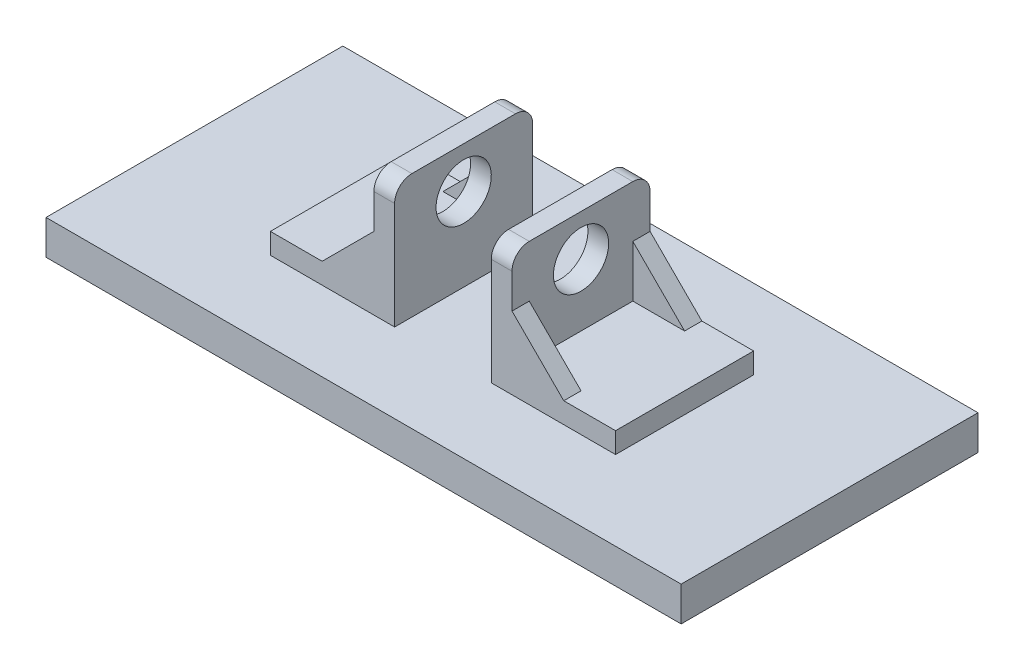
ISO-10303-21;
HEADER;
FILE_DESCRIPTION(('STEP AP214'),'2;1');
FILE_NAME('part.step','',(''),(''),'','','');
FILE_SCHEMA(('AUTOMOTIVE_DESIGN { 1 0 10303 214 1 1 1 1 }'));
ENDSEC;
DATA;
#1=APPLICATION_CONTEXT('core data for automotive mechanical design processes');
#2=APPLICATION_PROTOCOL_DEFINITION('international standard','automotive_design',2000,#1);
#3=PRODUCT_CONTEXT('',#1,'mechanical');
#4=PRODUCT('Part','Part','',(#3));
#5=PRODUCT_RELATED_PRODUCT_CATEGORY('part','',(#4));
#6=PRODUCT_DEFINITION_FORMATION('','',#4);
#7=PRODUCT_DEFINITION_CONTEXT('part definition',#1,'design');
#8=PRODUCT_DEFINITION('design','',#6,#7);
#9=PRODUCT_DEFINITION_SHAPE('','',#8);
#10=(LENGTH_UNIT() NAMED_UNIT(*) SI_UNIT(.MILLI.,.METRE.));
#11=(NAMED_UNIT(*) PLANE_ANGLE_UNIT() SI_UNIT($,.RADIAN.));
#12=(NAMED_UNIT(*) SI_UNIT($,.STERADIAN.) SOLID_ANGLE_UNIT());
#13=UNCERTAINTY_MEASURE_WITH_UNIT(LENGTH_MEASURE(1.E-05),#10,'distance_accuracy_value','');
#14=(GEOMETRIC_REPRESENTATION_CONTEXT(3) GLOBAL_UNCERTAINTY_ASSIGNED_CONTEXT((#13)) GLOBAL_UNIT_ASSIGNED_CONTEXT((#10,
#11,#12)) REPRESENTATION_CONTEXT('',''));
#15=CARTESIAN_POINT('',(0.,0.,0.));
#16=DIRECTION('',(0.,0.,1.));
#17=DIRECTION('',(1.,0.,0.));
#18=AXIS2_PLACEMENT_3D('',#15,#16,#17);
#19=CARTESIAN_POINT('',(20.,16.,20.));
#20=DIRECTION('',(0.,1.,0.));
#21=DIRECTION('',(0.,0.,1.));
#22=AXIS2_PLACEMENT_3D('',#19,#20,#21);
#23=PLANE('',#22);
#24=DIRECTION('',(1.,0.,0.));
#25=VECTOR('',#24,1.);
#26=CARTESIAN_POINT('',(20.,16.,-20.));
#27=LINE('',#26,#25);
#28=CARTESIAN_POINT('',(35.,16.,-20.));
#29=VERTEX_POINT('',#28);
#30=CARTESIAN_POINT('',(50.,16.,-20.));
#31=VERTEX_POINT('',#30);
#32=EDGE_CURVE('E320',#29,#31,#27,.T.);
#33=ORIENTED_EDGE('',*,*,#32,.F.);
#34=DIRECTION('',(0.,0.,1.));
#35=VECTOR('',#34,1.);
#36=CARTESIAN_POINT('',(35.,16.,-20.));
#37=LINE('',#36,#35);
#38=CARTESIAN_POINT('',(35.,16.,-15.));
#39=VERTEX_POINT('',#38);
#40=EDGE_CURVE('E239',#29,#39,#37,.T.);
#41=ORIENTED_EDGE('',*,*,#40,.T.);
#42=DIRECTION('',(1.,0.,0.));
#43=VECTOR('',#42,1.);
#44=CARTESIAN_POINT('',(0.,16.,-15.));
#45=LINE('',#44,#43);
#46=CARTESIAN_POINT('',(20.,16.,-15.));
#47=VERTEX_POINT('',#46);
#48=EDGE_CURVE('E241',#47,#39,#45,.T.);
#49=ORIENTED_EDGE('',*,*,#48,.F.);
#50=DIRECTION('',(0.,0.,-1.));
#51=VECTOR('',#50,1.);
#52=CARTESIAN_POINT('',(20.,16.,20.));
#53=LINE('',#52,#51);
#54=CARTESIAN_POINT('',(20.,16.,15.));
#55=VERTEX_POINT('',#54);
#56=EDGE_CURVE('E297',#55,#47,#53,.T.);
#57=ORIENTED_EDGE('',*,*,#56,.F.);
#58=DIRECTION('',(1.,0.,0.));
#59=VECTOR('',#58,1.);
#60=CARTESIAN_POINT('',(0.,16.,15.));
#61=LINE('',#60,#59);
#62=CARTESIAN_POINT('',(35.,16.,15.));
#63=VERTEX_POINT('',#62);
#64=EDGE_CURVE('E272',#55,#63,#61,.T.);
#65=ORIENTED_EDGE('',*,*,#64,.T.);
#66=DIRECTION('',(0.,0.,-1.));
#67=VECTOR('',#66,1.);
#68=CARTESIAN_POINT('',(35.,16.,20.));
#69=LINE('',#68,#67);
#70=CARTESIAN_POINT('',(35.,16.,20.));
#71=VERTEX_POINT('',#70);
#72=EDGE_CURVE('E271',#71,#63,#69,.T.);
#73=ORIENTED_EDGE('',*,*,#72,.F.);
#74=DIRECTION('',(1.,0.,0.));
#75=VECTOR('',#74,1.);
#76=CARTESIAN_POINT('',(20.,16.,20.));
#77=LINE('',#76,#75);
#78=CARTESIAN_POINT('',(50.,16.,20.));
#79=VERTEX_POINT('',#78);
#80=EDGE_CURVE('E232',#71,#79,#77,.T.);
#81=ORIENTED_EDGE('',*,*,#80,.T.);
#82=DIRECTION('',(0.,0.,-1.));
#83=VECTOR('',#82,1.);
#84=CARTESIAN_POINT('',(50.,16.,20.));
#85=LINE('',#84,#83);
#86=EDGE_CURVE('E298',#79,#31,#85,.T.);
#87=ORIENTED_EDGE('',*,*,#86,.T.);
#88=EDGE_LOOP('',(#33,#41,#49,#57,#65,#73,#81,#87));
#89=FACE_BOUND('',#88,.T.);
#90=ADVANCED_FACE('F35',(#89),#23,.T.);
#91=CARTESIAN_POINT('',(20.,46.,20.));
#92=DIRECTION('',(1.,0.,0.));
#93=DIRECTION('',(0.,1.,0.));
#94=AXIS2_PLACEMENT_3D('',#91,#92,#93);
#95=PLANE('',#94);
#96=CARTESIAN_POINT('',(20.,34.,0.));
#97=DIRECTION('',(1.,0.,0.));
#98=DIRECTION('',(0.,1.,0.));
#99=AXIS2_PLACEMENT_3D('',#96,#97,#98);
#100=CIRCLE('',#99,8.);
#101=CARTESIAN_POINT('',(20.,42.,0.));
#102=VERTEX_POINT('',#101);
#103=EDGE_CURVE('E409',#102,#102,#100,.F.);
#104=ORIENTED_EDGE('',*,*,#103,.T.);
#105=EDGE_LOOP('',(#104));
#106=FACE_BOUND('',#105,.T.);
#107=DIRECTION('',(0.,0.,-1.));
#108=VECTOR('',#107,1.);
#109=CARTESIAN_POINT('',(20.,46.,20.));
#110=LINE('',#109,#108);
#111=CARTESIAN_POINT('',(20.,46.,15.));
#112=VERTEX_POINT('',#111);
#113=CARTESIAN_POINT('',(20.,46.,-15.));
#114=VERTEX_POINT('',#113);
#115=EDGE_CURVE('E310',#112,#114,#110,.T.);
#116=ORIENTED_EDGE('',*,*,#115,.F.);
#117=CARTESIAN_POINT('',(20.,41.,15.));
#118=DIRECTION('',(1.,0.,0.));
#119=DIRECTION('',(0.,1.,0.));
#120=AXIS2_PLACEMENT_3D('',#117,#118,#119);
#121=CIRCLE('',#120,5.);
#122=CARTESIAN_POINT('',(20.,41.,20.));
#123=VERTEX_POINT('',#122);
#124=EDGE_CURVE('E431',#112,#123,#121,.T.);
#125=ORIENTED_EDGE('',*,*,#124,.T.);
#126=DIRECTION('',(0.,-1.,0.));
#127=VECTOR('',#126,1.);
#128=CARTESIAN_POINT('',(20.,46.,20.));
#129=LINE('',#128,#127);
#130=CARTESIAN_POINT('',(20.,31.,20.));
#131=VERTEX_POINT('',#130);
#132=EDGE_CURVE('E301',#123,#131,#129,.T.);
#133=ORIENTED_EDGE('',*,*,#132,.T.);
#134=DIRECTION('',(0.,0.,-1.));
#135=VECTOR('',#134,1.);
#136=CARTESIAN_POINT('',(20.,31.,20.));
#137=LINE('',#136,#135);
#138=CARTESIAN_POINT('',(20.,31.,15.));
#139=VERTEX_POINT('',#138);
#140=EDGE_CURVE('E280',#131,#139,#137,.T.);
#141=ORIENTED_EDGE('',*,*,#140,.T.);
#142=DIRECTION('',(0.,-1.,0.));
#143=VECTOR('',#142,1.);
#144=CARTESIAN_POINT('',(20.,0.,15.));
#145=LINE('',#144,#143);
#146=EDGE_CURVE('E275',#139,#55,#145,.T.);
#147=ORIENTED_EDGE('',*,*,#146,.T.);
#148=ORIENTED_EDGE('',*,*,#56,.T.);
#149=DIRECTION('',(0.,-1.,0.));
#150=VECTOR('',#149,1.);
#151=CARTESIAN_POINT('',(20.,0.,-15.));
#152=LINE('',#151,#150);
#153=CARTESIAN_POINT('',(20.,31.,-15.));
#154=VERTEX_POINT('',#153);
#155=EDGE_CURVE('E247',#154,#47,#152,.T.);
#156=ORIENTED_EDGE('',*,*,#155,.F.);
#157=DIRECTION('',(0.,0.,1.));
#158=VECTOR('',#157,1.);
#159=CARTESIAN_POINT('',(20.,31.,-20.));
#160=LINE('',#159,#158);
#161=CARTESIAN_POINT('',(20.,31.,-20.));
#162=VERTEX_POINT('',#161);
#163=EDGE_CURVE('E236',#162,#154,#160,.T.);
#164=ORIENTED_EDGE('',*,*,#163,.F.);
#165=DIRECTION('',(0.,-1.,0.));
#166=VECTOR('',#165,1.);
#167=CARTESIAN_POINT('',(20.,46.,-20.));
#168=LINE('',#167,#166);
#169=CARTESIAN_POINT('',(20.,41.,-20.));
#170=VERTEX_POINT('',#169);
#171=EDGE_CURVE('E223',#170,#162,#168,.T.);
#172=ORIENTED_EDGE('',*,*,#171,.F.);
#173=CARTESIAN_POINT('',(20.,41.,-15.));
#174=DIRECTION('',(1.,0.,0.));
#175=DIRECTION('',(0.,1.,0.));
#176=AXIS2_PLACEMENT_3D('',#173,#174,#175);
#177=CIRCLE('',#176,5.);
#178=EDGE_CURVE('E429',#170,#114,#177,.T.);
#179=ORIENTED_EDGE('',*,*,#178,.T.);
#180=EDGE_LOOP('',(#116,#125,#133,#141,#147,#148,#156,#164,#172,#179));
#181=FACE_BOUND('',#180,.T.);
#182=ADVANCED_FACE('F245',(#106,#181),#95,.T.);
#183=CARTESIAN_POINT('',(-20.,46.,20.));
#184=DIRECTION('',(1.,0.,0.));
#185=DIRECTION('',(0.,1.,0.));
#186=AXIS2_PLACEMENT_3D('',#183,#184,#185);
#187=PLANE('',#186);
#188=CARTESIAN_POINT('',(-20.,34.,0.));
#189=DIRECTION('',(-1.,0.,0.));
#190=DIRECTION('',(0.,-1.,0.));
#191=AXIS2_PLACEMENT_3D('',#188,#189,#190);
#192=CIRCLE('',#191,8.);
#193=CARTESIAN_POINT('',(-20.,26.,0.));
#194=VERTEX_POINT('',#193);
#195=EDGE_CURVE('E470',#194,#194,#192,.T.);
#196=ORIENTED_EDGE('',*,*,#195,.F.);
#197=EDGE_LOOP('',(#196));
#198=FACE_BOUND('',#197,.T.);
#199=DIRECTION('',(0.,0.,-1.));
#200=VECTOR('',#199,1.);
#201=CARTESIAN_POINT('',(-20.,46.,20.));
#202=LINE('',#201,#200);
#203=CARTESIAN_POINT('',(-20.,46.,15.));
#204=VERTEX_POINT('',#203);
#205=CARTESIAN_POINT('',(-20.,46.,-15.));
#206=VERTEX_POINT('',#205);
#207=EDGE_CURVE('E365',#204,#206,#202,.T.);
#208=ORIENTED_EDGE('',*,*,#207,.T.);
#209=CARTESIAN_POINT('',(-20.,41.,-15.));
#210=DIRECTION('',(1.,0.,0.));
#211=DIRECTION('',(0.,1.,0.));
#212=AXIS2_PLACEMENT_3D('',#209,#210,#211);
#213=CIRCLE('',#212,5.);
#214=CARTESIAN_POINT('',(-20.,41.,-20.));
#215=VERTEX_POINT('',#214);
#216=EDGE_CURVE('E416',#206,#215,#213,.F.);
#217=ORIENTED_EDGE('',*,*,#216,.T.);
#218=DIRECTION('',(0.,-1.,0.));
#219=VECTOR('',#218,1.);
#220=CARTESIAN_POINT('',(-20.,46.,-20.));
#221=LINE('',#220,#219);
#222=CARTESIAN_POINT('',(-20.,31.0000000000001,-20.));
#223=VERTEX_POINT('',#222);
#224=EDGE_CURVE('E352',#215,#223,#221,.T.);
#225=ORIENTED_EDGE('',*,*,#224,.T.);
#226=DIRECTION('',(0.,0.,1.));
#227=VECTOR('',#226,1.);
#228=CARTESIAN_POINT('',(-20.,31.,-20.));
#229=LINE('',#228,#227);
#230=CARTESIAN_POINT('',(-20.,31.,-15.));
#231=VERTEX_POINT('',#230);
#232=EDGE_CURVE('E256',#223,#231,#229,.T.);
#233=ORIENTED_EDGE('',*,*,#232,.T.);
#234=DIRECTION('',(0.,-1.,0.));
#235=VECTOR('',#234,1.);
#236=CARTESIAN_POINT('',(-20.,0.,-15.));
#237=LINE('',#236,#235);
#238=CARTESIAN_POINT('',(-20.,16.,-15.));
#239=VERTEX_POINT('',#238);
#240=EDGE_CURVE('E249',#231,#239,#237,.T.);
#241=ORIENTED_EDGE('',*,*,#240,.T.);
#242=DIRECTION('',(0.,0.,-1.));
#243=VECTOR('',#242,1.);
#244=CARTESIAN_POINT('',(-20.,16.,20.));
#245=LINE('',#244,#243);
#246=CARTESIAN_POINT('',(-20.,16.,15.));
#247=VERTEX_POINT('',#246);
#248=EDGE_CURVE('E362',#247,#239,#245,.T.);
#249=ORIENTED_EDGE('',*,*,#248,.F.);
#250=DIRECTION('',(0.,-1.,0.));
#251=VECTOR('',#250,1.);
#252=CARTESIAN_POINT('',(-20.,0.,15.));
#253=LINE('',#252,#251);
#254=CARTESIAN_POINT('',(-20.,31.,15.));
#255=VERTEX_POINT('',#254);
#256=EDGE_CURVE('E282',#255,#247,#253,.T.);
#257=ORIENTED_EDGE('',*,*,#256,.F.);
#258=DIRECTION('',(0.,0.,-1.));
#259=VECTOR('',#258,1.);
#260=CARTESIAN_POINT('',(-20.,31.,20.));
#261=LINE('',#260,#259);
#262=CARTESIAN_POINT('',(-20.,31.,20.));
#263=VERTEX_POINT('',#262);
#264=EDGE_CURVE('E295',#263,#255,#261,.T.);
#265=ORIENTED_EDGE('',*,*,#264,.F.);
#266=DIRECTION('',(0.,-1.,0.));
#267=VECTOR('',#266,1.);
#268=CARTESIAN_POINT('',(-20.,46.,20.));
#269=LINE('',#268,#267);
#270=CARTESIAN_POINT('',(-20.,41.,20.));
#271=VERTEX_POINT('',#270);
#272=EDGE_CURVE('E340',#271,#263,#269,.T.);
#273=ORIENTED_EDGE('',*,*,#272,.F.);
#274=CARTESIAN_POINT('',(-20.,41.,15.));
#275=DIRECTION('',(1.,0.,0.));
#276=DIRECTION('',(0.,1.,0.));
#277=AXIS2_PLACEMENT_3D('',#274,#275,#276);
#278=CIRCLE('',#277,5.);
#279=EDGE_CURVE('E414',#271,#204,#278,.F.);
#280=ORIENTED_EDGE('',*,*,#279,.T.);
#281=EDGE_LOOP('',(#208,#217,#225,#233,#241,#249,#257,#265,#273,#280));
#282=FACE_BOUND('',#281,.T.);
#283=ADVANCED_FACE('F477',(#198,#282),#187,.F.);
#284=CARTESIAN_POINT('',(-20.,16.,20.));
#285=DIRECTION('',(0.,-1.,0.));
#286=DIRECTION('',(0.,0.,-1.));
#287=AXIS2_PLACEMENT_3D('',#284,#285,#286);
#288=PLANE('',#287);
#289=DIRECTION('',(-1.,0.,0.));
#290=VECTOR('',#289,1.);
#291=CARTESIAN_POINT('',(0.,16.,-15.));
#292=LINE('',#291,#290);
#293=CARTESIAN_POINT('',(-35.,16.,-15.));
#294=VERTEX_POINT('',#293);
#295=EDGE_CURVE('E257',#239,#294,#292,.T.);
#296=ORIENTED_EDGE('',*,*,#295,.T.);
#297=DIRECTION('',(0.,0.,1.));
#298=VECTOR('',#297,1.);
#299=CARTESIAN_POINT('',(-35.,16.,-20.));
#300=LINE('',#299,#298);
#301=CARTESIAN_POINT('',(-35.,16.,-20.));
#302=VERTEX_POINT('',#301);
#303=EDGE_CURVE('E263',#302,#294,#300,.T.);
#304=ORIENTED_EDGE('',*,*,#303,.F.);
#305=DIRECTION('',(-1.,0.,0.));
#306=VECTOR('',#305,1.);
#307=CARTESIAN_POINT('',(-20.,16.,-20.));
#308=LINE('',#307,#306);
#309=CARTESIAN_POINT('',(-50.,16.,-20.));
#310=VERTEX_POINT('',#309);
#311=EDGE_CURVE('E354',#302,#310,#308,.T.);
#312=ORIENTED_EDGE('',*,*,#311,.T.);
#313=DIRECTION('',(0.,0.,-1.));
#314=VECTOR('',#313,1.);
#315=CARTESIAN_POINT('',(-50.,16.,20.));
#316=LINE('',#315,#314);
#317=CARTESIAN_POINT('',(-50.,16.,20.));
#318=VERTEX_POINT('',#317);
#319=EDGE_CURVE('E359',#318,#310,#316,.T.);
#320=ORIENTED_EDGE('',*,*,#319,.F.);
#321=DIRECTION('',(-1.,0.,0.));
#322=VECTOR('',#321,1.);
#323=CARTESIAN_POINT('',(-20.,16.,20.));
#324=LINE('',#323,#322);
#325=CARTESIAN_POINT('',(-35.,16.,20.));
#326=VERTEX_POINT('',#325);
#327=EDGE_CURVE('E342',#326,#318,#324,.T.);
#328=ORIENTED_EDGE('',*,*,#327,.F.);
#329=DIRECTION('',(0.,0.,-1.));
#330=VECTOR('',#329,1.);
#331=CARTESIAN_POINT('',(-35.,16.,20.));
#332=LINE('',#331,#330);
#333=CARTESIAN_POINT('',(-35.,16.,15.));
#334=VERTEX_POINT('',#333);
#335=EDGE_CURVE('E286',#326,#334,#332,.T.);
#336=ORIENTED_EDGE('',*,*,#335,.T.);
#337=DIRECTION('',(-1.,0.,0.));
#338=VECTOR('',#337,1.);
#339=CARTESIAN_POINT('',(0.,16.,15.));
#340=LINE('',#339,#338);
#341=EDGE_CURVE('E287',#247,#334,#340,.T.);
#342=ORIENTED_EDGE('',*,*,#341,.F.);
#343=ORIENTED_EDGE('',*,*,#248,.T.);
#344=EDGE_LOOP('',(#296,#304,#312,#320,#328,#336,#342,#343));
#345=FACE_BOUND('',#344,.T.);
#346=ADVANCED_FACE('F480',(#345),#288,.F.);
#347=CARTESIAN_POINT('',(0.,10.,0.));
#348=DIRECTION('',(0.,-1.,0.));
#349=DIRECTION('',(0.,0.,-1.));
#350=AXIS2_PLACEMENT_3D('',#347,#348,#349);
#351=PLANE('',#350);
#352=DIRECTION('',(0.,0.,1.));
#353=VECTOR('',#352,1.);
#354=CARTESIAN_POINT('',(-92.0000000000001,10.,-43.));
#355=LINE('',#354,#353);
#356=CARTESIAN_POINT('',(-92.0000000000001,10.,-43.));
#357=VERTEX_POINT('',#356);
#358=CARTESIAN_POINT('',(-92.,10.,43.));
#359=VERTEX_POINT('',#358);
#360=EDGE_CURVE('E375',#357,#359,#355,.T.);
#361=ORIENTED_EDGE('',*,*,#360,.T.);
#362=DIRECTION('',(1.,0.,0.));
#363=VECTOR('',#362,1.);
#364=CARTESIAN_POINT('',(92.,10.,43.));
#365=LINE('',#364,#363);
#366=CARTESIAN_POINT('',(92.,10.,43.));
#367=VERTEX_POINT('',#366);
#368=EDGE_CURVE('E378',#359,#367,#365,.T.);
#369=ORIENTED_EDGE('',*,*,#368,.T.);
#370=DIRECTION('',(0.,0.,-1.));
#371=VECTOR('',#370,1.);
#372=CARTESIAN_POINT('',(91.9999999999999,10.,-43.));
#373=LINE('',#372,#371);
#374=CARTESIAN_POINT('',(91.9999999999999,10.,-43.));
#375=VERTEX_POINT('',#374);
#376=EDGE_CURVE('E381',#367,#375,#373,.T.);
#377=ORIENTED_EDGE('',*,*,#376,.T.);
#378=DIRECTION('',(-1.,0.,0.));
#379=VECTOR('',#378,1.);
#380=CARTESIAN_POINT('',(91.9999999999999,10.,-43.));
#381=LINE('',#380,#379);
#382=EDGE_CURVE('E383',#375,#357,#381,.T.);
#383=ORIENTED_EDGE('',*,*,#382,.T.);
#384=EDGE_LOOP('',(#361,#369,#377,#383));
#385=FACE_BOUND('',#384,.T.);
#386=DIRECTION('',(0.,0.,-1.));
#387=VECTOR('',#386,1.);
#388=CARTESIAN_POINT('',(-14.,10.,20.));
#389=LINE('',#388,#387);
#390=CARTESIAN_POINT('',(-14.,10.,20.));
#391=VERTEX_POINT('',#390);
#392=CARTESIAN_POINT('',(-14.,10.,-20.));
#393=VERTEX_POINT('',#392);
#394=EDGE_CURVE('E371',#391,#393,#389,.T.);
#395=ORIENTED_EDGE('',*,*,#394,.F.);
#396=DIRECTION('',(1.,0.,0.));
#397=VECTOR('',#396,1.);
#398=CARTESIAN_POINT('',(-50.,10.,20.));
#399=LINE('',#398,#397);
#400=CARTESIAN_POINT('',(-50.,10.,20.));
#401=VERTEX_POINT('',#400);
#402=EDGE_CURVE('E333',#401,#391,#399,.T.);
#403=ORIENTED_EDGE('',*,*,#402,.F.);
#404=DIRECTION('',(0.,0.,-1.));
#405=VECTOR('',#404,1.);
#406=CARTESIAN_POINT('',(-50.,10.,20.));
#407=LINE('',#406,#405);
#408=CARTESIAN_POINT('',(-50.,10.,-20.));
#409=VERTEX_POINT('',#408);
#410=EDGE_CURVE('E347',#401,#409,#407,.T.);
#411=ORIENTED_EDGE('',*,*,#410,.T.);
#412=DIRECTION('',(1.,0.,0.));
#413=VECTOR('',#412,1.);
#414=CARTESIAN_POINT('',(-50.,10.,-20.));
#415=LINE('',#414,#413);
#416=EDGE_CURVE('E322',#409,#393,#415,.T.);
#417=ORIENTED_EDGE('',*,*,#416,.T.);
#418=EDGE_LOOP('',(#395,#403,#411,#417));
#419=FACE_BOUND('',#418,.T.);
#420=DIRECTION('',(-1.,0.,0.));
#421=VECTOR('',#420,1.);
#422=CARTESIAN_POINT('',(50.,10.,20.));
#423=LINE('',#422,#421);
#424=CARTESIAN_POINT('',(50.,10.,20.));
#425=VERTEX_POINT('',#424);
#426=CARTESIAN_POINT('',(14.,10.,20.));
#427=VERTEX_POINT('',#426);
#428=EDGE_CURVE('E326',#425,#427,#423,.T.);
#429=ORIENTED_EDGE('',*,*,#428,.T.);
#430=DIRECTION('',(0.,0.,-1.));
#431=VECTOR('',#430,1.);
#432=CARTESIAN_POINT('',(14.,10.,20.));
#433=LINE('',#432,#431);
#434=CARTESIAN_POINT('',(14.,10.,-20.));
#435=VERTEX_POINT('',#434);
#436=EDGE_CURVE('E305',#427,#435,#433,.T.);
#437=ORIENTED_EDGE('',*,*,#436,.T.);
#438=DIRECTION('',(-1.,0.,0.));
#439=VECTOR('',#438,1.);
#440=CARTESIAN_POINT('',(50.,10.,-20.));
#441=LINE('',#440,#439);
#442=CARTESIAN_POINT('',(50.,10.,-20.));
#443=VERTEX_POINT('',#442);
#444=EDGE_CURVE('E315',#443,#435,#441,.T.);
#445=ORIENTED_EDGE('',*,*,#444,.F.);
#446=DIRECTION('',(0.,0.,-1.));
#447=VECTOR('',#446,1.);
#448=CARTESIAN_POINT('',(50.,10.,20.));
#449=LINE('',#448,#447);
#450=EDGE_CURVE('E302',#425,#443,#449,.T.);
#451=ORIENTED_EDGE('',*,*,#450,.F.);
#452=EDGE_LOOP('',(#429,#437,#445,#451));
#453=FACE_BOUND('',#452,.T.);
#454=ADVANCED_FACE('F501',(#385,#419,#453),#351,.F.);
#455=CARTESIAN_POINT('',(-92.0000000000001,10.,-43.));
#456=DIRECTION('',(1.,0.,0.));
#457=DIRECTION('',(0.,0.,-1.));
#458=AXIS2_PLACEMENT_3D('',#455,#456,#457);
#459=PLANE('',#458);
#460=DIRECTION('',(0.,0.,1.));
#461=VECTOR('',#460,1.);
#462=CARTESIAN_POINT('',(-92.0000000000001,0.,-43.));
#463=LINE('',#462,#461);
#464=CARTESIAN_POINT('',(-92.0000000000001,0.,-43.));
#465=VERTEX_POINT('',#464);
#466=CARTESIAN_POINT('',(-92.,0.,43.));
#467=VERTEX_POINT('',#466);
#468=EDGE_CURVE('E374',#465,#467,#463,.T.);
#469=ORIENTED_EDGE('',*,*,#468,.T.);
#470=DIRECTION('',(0.,-1.,0.));
#471=VECTOR('',#470,1.);
#472=CARTESIAN_POINT('',(-92.,10.,43.));
#473=LINE('',#472,#471);
#474=EDGE_CURVE('E401',#359,#467,#473,.T.);
#475=ORIENTED_EDGE('',*,*,#474,.F.);
#476=ORIENTED_EDGE('',*,*,#360,.F.);
#477=DIRECTION('',(0.,-1.,0.));
#478=VECTOR('',#477,1.);
#479=CARTESIAN_POINT('',(-92.0000000000001,10.,-43.));
#480=LINE('',#479,#478);
#481=EDGE_CURVE('E385',#357,#465,#480,.T.);
#482=ORIENTED_EDGE('',*,*,#481,.T.);
#483=EDGE_LOOP('',(#469,#475,#476,#482));
#484=FACE_BOUND('',#483,.T.);
#485=ADVANCED_FACE('F759',(#484),#459,.F.);
#486=CARTESIAN_POINT('',(92.,10.,43.));
#487=DIRECTION('',(0.,0.,-1.));
#488=DIRECTION('',(-1.,0.,0.));
#489=AXIS2_PLACEMENT_3D('',#486,#487,#488);
#490=PLANE('',#489);
#491=DIRECTION('',(1.,0.,0.));
#492=VECTOR('',#491,1.);
#493=CARTESIAN_POINT('',(92.,0.,43.));
#494=LINE('',#493,#492);
#495=CARTESIAN_POINT('',(92.,0.,43.));
#496=VERTEX_POINT('',#495);
#497=EDGE_CURVE('E388',#467,#496,#494,.T.);
#498=ORIENTED_EDGE('',*,*,#497,.T.);
#499=DIRECTION('',(0.,-1.,0.));
#500=VECTOR('',#499,1.);
#501=CARTESIAN_POINT('',(92.,10.,43.));
#502=LINE('',#501,#500);
#503=EDGE_CURVE('E398',#367,#496,#502,.T.);
#504=ORIENTED_EDGE('',*,*,#503,.F.);
#505=ORIENTED_EDGE('',*,*,#368,.F.);
#506=ORIENTED_EDGE('',*,*,#474,.T.);
#507=EDGE_LOOP('',(#498,#504,#505,#506));
#508=FACE_BOUND('',#507,.T.);
#509=ADVANCED_FACE('F768',(#508),#490,.F.);
#510=CARTESIAN_POINT('',(91.9999999999999,10.,-43.));
#511=DIRECTION('',(-1.,0.,0.));
#512=DIRECTION('',(0.,0.,1.));
#513=AXIS2_PLACEMENT_3D('',#510,#511,#512);
#514=PLANE('',#513);
#515=DIRECTION('',(0.,0.,-1.));
#516=VECTOR('',#515,1.);
#517=CARTESIAN_POINT('',(91.9999999999999,0.,-43.));
#518=LINE('',#517,#516);
#519=CARTESIAN_POINT('',(91.9999999999999,0.,-43.));
#520=VERTEX_POINT('',#519);
#521=EDGE_CURVE('E390',#496,#520,#518,.T.);
#522=ORIENTED_EDGE('',*,*,#521,.T.);
#523=DIRECTION('',(0.,-1.,0.));
#524=VECTOR('',#523,1.);
#525=CARTESIAN_POINT('',(91.9999999999999,10.,-43.));
#526=LINE('',#525,#524);
#527=EDGE_CURVE('E395',#375,#520,#526,.T.);
#528=ORIENTED_EDGE('',*,*,#527,.F.);
#529=ORIENTED_EDGE('',*,*,#376,.F.);
#530=ORIENTED_EDGE('',*,*,#503,.T.);
#531=EDGE_LOOP('',(#522,#528,#529,#530));
#532=FACE_BOUND('',#531,.T.);
#533=ADVANCED_FACE('F776',(#532),#514,.F.);
#534=CARTESIAN_POINT('',(91.9999999999999,10.,-43.));
#535=DIRECTION('',(0.,0.,1.));
#536=DIRECTION('',(1.,0.,0.));
#537=AXIS2_PLACEMENT_3D('',#534,#535,#536);
#538=PLANE('',#537);
#539=DIRECTION('',(-1.,0.,0.));
#540=VECTOR('',#539,1.);
#541=CARTESIAN_POINT('',(91.9999999999999,0.,-43.));
#542=LINE('',#541,#540);
#543=EDGE_CURVE('E379',#520,#465,#542,.T.);
#544=ORIENTED_EDGE('',*,*,#543,.T.);
#545=ORIENTED_EDGE('',*,*,#481,.F.);
#546=ORIENTED_EDGE('',*,*,#382,.F.);
#547=ORIENTED_EDGE('',*,*,#527,.T.);
#548=EDGE_LOOP('',(#544,#545,#546,#547));
#549=FACE_BOUND('',#548,.T.);
#550=ADVANCED_FACE('F784',(#549),#538,.F.);
#551=CARTESIAN_POINT('',(0.,0.,0.));
#552=DIRECTION('',(0.,-1.,0.));
#553=DIRECTION('',(0.,0.,-1.));
#554=AXIS2_PLACEMENT_3D('',#551,#552,#553);
#555=PLANE('',#554);
#556=ORIENTED_EDGE('',*,*,#468,.F.);
#557=ORIENTED_EDGE('',*,*,#543,.F.);
#558=ORIENTED_EDGE('',*,*,#521,.F.);
#559=ORIENTED_EDGE('',*,*,#497,.F.);
#560=EDGE_LOOP('',(#556,#557,#558,#559));
#561=FACE_BOUND('',#560,.T.);
#562=ADVANCED_FACE('F792',(#561),#555,.T.);
#563=CARTESIAN_POINT('',(-14.,10.,20.));
#564=DIRECTION('',(-1.,0.,0.));
#565=DIRECTION('',(0.,0.,1.));
#566=AXIS2_PLACEMENT_3D('',#563,#564,#565);
#567=PLANE('',#566);
#568=CARTESIAN_POINT('',(-14.,34.,0.));
#569=DIRECTION('',(-1.,0.,0.));
#570=DIRECTION('',(0.,0.,1.));
#571=AXIS2_PLACEMENT_3D('',#568,#569,#570);
#572=CIRCLE('',#571,8.);
#573=CARTESIAN_POINT('',(-14.,34.,8.));
#574=VERTEX_POINT('',#573);
#575=EDGE_CURVE('E408',#574,#574,#572,.T.);
#576=ORIENTED_EDGE('',*,*,#575,.T.);
#577=EDGE_LOOP('',(#576));
#578=FACE_BOUND('',#577,.T.);
#579=DIRECTION('',(0.,1.,0.));
#580=VECTOR('',#579,1.);
#581=CARTESIAN_POINT('',(-14.,10.,-20.));
#582=LINE('',#581,#580);
#583=CARTESIAN_POINT('',(-14.,41.,-20.));
#584=VERTEX_POINT('',#583);
#585=EDGE_CURVE('E349',#393,#584,#582,.T.);
#586=ORIENTED_EDGE('',*,*,#585,.T.);
#587=CARTESIAN_POINT('',(-14.,41.,-15.));
#588=DIRECTION('',(-1.,0.,0.));
#589=DIRECTION('',(0.,0.,1.));
#590=AXIS2_PLACEMENT_3D('',#587,#588,#589);
#591=CIRCLE('',#590,5.);
#592=CARTESIAN_POINT('',(-14.,46.,-15.));
#593=VERTEX_POINT('',#592);
#594=EDGE_CURVE('E422',#584,#593,#591,.F.);
#595=ORIENTED_EDGE('',*,*,#594,.T.);
#596=DIRECTION('',(0.,0.,-1.));
#597=VECTOR('',#596,1.);
#598=CARTESIAN_POINT('',(-14.,46.,20.));
#599=LINE('',#598,#597);
#600=CARTESIAN_POINT('',(-14.,46.,15.));
#601=VERTEX_POINT('',#600);
#602=EDGE_CURVE('E368',#601,#593,#599,.T.);
#603=ORIENTED_EDGE('',*,*,#602,.F.);
#604=CARTESIAN_POINT('',(-14.,41.,15.));
#605=DIRECTION('',(-1.,0.,0.));
#606=DIRECTION('',(0.,0.,1.));
#607=AXIS2_PLACEMENT_3D('',#604,#605,#606);
#608=CIRCLE('',#607,5.);
#609=CARTESIAN_POINT('',(-14.,41.,20.));
#610=VERTEX_POINT('',#609);
#611=EDGE_CURVE('E420',#601,#610,#608,.F.);
#612=ORIENTED_EDGE('',*,*,#611,.T.);
#613=DIRECTION('',(0.,1.,0.));
#614=VECTOR('',#613,1.);
#615=CARTESIAN_POINT('',(-14.,10.,20.));
#616=LINE('',#615,#614);
#617=EDGE_CURVE('E336',#391,#610,#616,.T.);
#618=ORIENTED_EDGE('',*,*,#617,.F.);
#619=ORIENTED_EDGE('',*,*,#394,.T.);
#620=EDGE_LOOP('',(#586,#595,#603,#612,#618,#619));
#621=FACE_BOUND('',#620,.T.);
#622=ADVANCED_FACE('F495',(#578,#621),#567,.F.);
#623=CARTESIAN_POINT('',(-14.,46.,20.));
#624=DIRECTION('',(0.,-1.,0.));
#625=DIRECTION('',(1.,0.,0.));
#626=AXIS2_PLACEMENT_3D('',#623,#624,#625);
#627=PLANE('',#626);
#628=ORIENTED_EDGE('',*,*,#602,.T.);
#629=DIRECTION('',(-1.,0.,0.));
#630=VECTOR('',#629,1.);
#631=CARTESIAN_POINT('',(-14.,46.,-15.));
#632=LINE('',#631,#630);
#633=EDGE_CURVE('E411',#593,#206,#632,.T.);
#634=ORIENTED_EDGE('',*,*,#633,.T.);
#635=ORIENTED_EDGE('',*,*,#207,.F.);
#636=DIRECTION('',(-1.,0.,0.));
#637=VECTOR('',#636,1.);
#638=CARTESIAN_POINT('',(-14.,46.,15.));
#639=LINE('',#638,#637);
#640=EDGE_CURVE('E404',#204,#601,#639,.F.);
#641=ORIENTED_EDGE('',*,*,#640,.T.);
#642=EDGE_LOOP('',(#628,#634,#635,#641));
#643=FACE_BOUND('',#642,.T.);
#644=ADVANCED_FACE('F487',(#643),#627,.F.);
#645=CARTESIAN_POINT('',(-50.,16.,20.));
#646=DIRECTION('',(1.,0.,0.));
#647=DIRECTION('',(0.,0.,-1.));
#648=AXIS2_PLACEMENT_3D('',#645,#646,#647);
#649=PLANE('',#648);
#650=DIRECTION('',(0.,-1.,0.));
#651=VECTOR('',#650,1.);
#652=CARTESIAN_POINT('',(-50.,16.,-20.));
#653=LINE('',#652,#651);
#654=EDGE_CURVE('E337',#310,#409,#653,.T.);
#655=ORIENTED_EDGE('',*,*,#654,.T.);
#656=ORIENTED_EDGE('',*,*,#410,.F.);
#657=DIRECTION('',(0.,-1.,0.));
#658=VECTOR('',#657,1.);
#659=CARTESIAN_POINT('',(-50.,16.,20.));
#660=LINE('',#659,#658);
#661=EDGE_CURVE('E344',#318,#401,#660,.T.);
#662=ORIENTED_EDGE('',*,*,#661,.F.);
#663=ORIENTED_EDGE('',*,*,#319,.T.);
#664=EDGE_LOOP('',(#655,#656,#662,#663));
#665=FACE_BOUND('',#664,.T.);
#666=ADVANCED_FACE('F536',(#665),#649,.F.);
#667=CARTESIAN_POINT('',(0.,0.,20.));
#668=DIRECTION('',(0.,0.,1.));
#669=DIRECTION('',(1.,0.,0.));
#670=AXIS2_PLACEMENT_3D('',#667,#668,#669);
#671=PLANE('',#670);
#672=ORIENTED_EDGE('',*,*,#617,.T.);
#673=DIRECTION('',(-1.,0.,0.));
#674=VECTOR('',#673,1.);
#675=CARTESIAN_POINT('',(-20.,41.,20.));
#676=LINE('',#675,#674);
#677=EDGE_CURVE('E11',#610,#271,#676,.T.);
#678=ORIENTED_EDGE('',*,*,#677,.T.);
#679=ORIENTED_EDGE('',*,*,#272,.T.);
#680=DIRECTION('',(-0.707106781186546,-0.707106781186549,0.));
#681=VECTOR('',#680,1.);
#682=CARTESIAN_POINT('',(-25.5000000000001,25.5,20.));
#683=LINE('',#682,#681);
#684=EDGE_CURVE('E283',#263,#326,#683,.T.);
#685=ORIENTED_EDGE('',*,*,#684,.T.);
#686=ORIENTED_EDGE('',*,*,#327,.T.);
#687=ORIENTED_EDGE('',*,*,#661,.T.);
#688=ORIENTED_EDGE('',*,*,#402,.T.);
#689=EDGE_LOOP('',(#672,#678,#679,#685,#686,#687,#688));
#690=FACE_BOUND('',#689,.T.);
#691=ADVANCED_FACE('F497',(#690),#671,.T.);
#692=CARTESIAN_POINT('',(0.,0.,-20.));
#693=DIRECTION('',(0.,0.,1.));
#694=DIRECTION('',(1.,0.,0.));
#695=AXIS2_PLACEMENT_3D('',#692,#693,#694);
#696=PLANE('',#695);
#697=ORIENTED_EDGE('',*,*,#224,.F.);
#698=DIRECTION('',(-1.,0.,0.));
#699=VECTOR('',#698,1.);
#700=CARTESIAN_POINT('',(0.,41.,-20.));
#701=LINE('',#700,#699);
#702=EDGE_CURVE('E418',#215,#584,#701,.F.);
#703=ORIENTED_EDGE('',*,*,#702,.T.);
#704=ORIENTED_EDGE('',*,*,#585,.F.);
#705=ORIENTED_EDGE('',*,*,#416,.F.);
#706=ORIENTED_EDGE('',*,*,#654,.F.);
#707=ORIENTED_EDGE('',*,*,#311,.F.);
#708=DIRECTION('',(-0.707106781186546,-0.707106781186549,0.));
#709=VECTOR('',#708,1.);
#710=CARTESIAN_POINT('',(-25.5000000000001,25.5,-20.));
#711=LINE('',#710,#709);
#712=EDGE_CURVE('E253',#223,#302,#711,.T.);
#713=ORIENTED_EDGE('',*,*,#712,.F.);
#714=EDGE_LOOP('',(#697,#703,#704,#705,#706,#707,#713));
#715=FACE_BOUND('',#714,.T.);
#716=ADVANCED_FACE('F510',(#715),#696,.F.);
#717=CARTESIAN_POINT('',(14.,46.,20.));
#718=DIRECTION('',(0.,1.,0.));
#719=DIRECTION('',(-1.,0.,0.));
#720=AXIS2_PLACEMENT_3D('',#717,#718,#719);
#721=PLANE('',#720);
#722=DIRECTION('',(0.,0.,-1.));
#723=VECTOR('',#722,1.);
#724=CARTESIAN_POINT('',(14.,46.,20.));
#725=LINE('',#724,#723);
#726=CARTESIAN_POINT('',(14.,46.,15.));
#727=VERTEX_POINT('',#726);
#728=CARTESIAN_POINT('',(14.,46.,-15.));
#729=VERTEX_POINT('',#728);
#730=EDGE_CURVE('E308',#727,#729,#725,.T.);
#731=ORIENTED_EDGE('',*,*,#730,.F.);
#732=DIRECTION('',(1.,0.,0.));
#733=VECTOR('',#732,1.);
#734=CARTESIAN_POINT('',(20.,46.,15.));
#735=LINE('',#734,#733);
#736=EDGE_CURVE('E426',#727,#112,#735,.T.);
#737=ORIENTED_EDGE('',*,*,#736,.T.);
#738=ORIENTED_EDGE('',*,*,#115,.T.);
#739=DIRECTION('',(1.,0.,0.));
#740=VECTOR('',#739,1.);
#741=CARTESIAN_POINT('',(14.,46.,-15.));
#742=LINE('',#741,#740);
#743=EDGE_CURVE('E424',#114,#729,#742,.F.);
#744=ORIENTED_EDGE('',*,*,#743,.T.);
#745=EDGE_LOOP('',(#731,#737,#738,#744));
#746=FACE_BOUND('',#745,.T.);
#747=ADVANCED_FACE('F442',(#746),#721,.T.);
#748=CARTESIAN_POINT('',(14.,10.,20.));
#749=DIRECTION('',(-1.,0.,0.));
#750=DIRECTION('',(0.,0.,1.));
#751=AXIS2_PLACEMENT_3D('',#748,#749,#750);
#752=PLANE('',#751);
#753=CARTESIAN_POINT('',(14.,34.,0.));
#754=DIRECTION('',(-1.,0.,0.));
#755=DIRECTION('',(0.,0.,1.));
#756=AXIS2_PLACEMENT_3D('',#753,#754,#755);
#757=CIRCLE('',#756,8.);
#758=CARTESIAN_POINT('',(14.,34.,8.));
#759=VERTEX_POINT('',#758);
#760=EDGE_CURVE('E405',#759,#759,#757,.T.);
#761=ORIENTED_EDGE('',*,*,#760,.F.);
#762=EDGE_LOOP('',(#761));
#763=FACE_BOUND('',#762,.T.);
#764=DIRECTION('',(0.,1.,0.));
#765=VECTOR('',#764,1.);
#766=CARTESIAN_POINT('',(14.,10.,20.));
#767=LINE('',#766,#765);
#768=CARTESIAN_POINT('',(14.,41.,20.));
#769=VERTEX_POINT('',#768);
#770=EDGE_CURVE('E324',#427,#769,#767,.T.);
#771=ORIENTED_EDGE('',*,*,#770,.T.);
#772=CARTESIAN_POINT('',(14.,41.,15.));
#773=DIRECTION('',(-1.,0.,0.));
#774=DIRECTION('',(0.,0.,1.));
#775=AXIS2_PLACEMENT_3D('',#772,#773,#774);
#776=CIRCLE('',#775,5.);
#777=EDGE_CURVE('E435',#769,#727,#776,.T.);
#778=ORIENTED_EDGE('',*,*,#777,.T.);
#779=ORIENTED_EDGE('',*,*,#730,.T.);
#780=CARTESIAN_POINT('',(14.,41.,-15.));
#781=DIRECTION('',(-1.,0.,0.));
#782=DIRECTION('',(0.,0.,1.));
#783=AXIS2_PLACEMENT_3D('',#780,#781,#782);
#784=CIRCLE('',#783,5.);
#785=CARTESIAN_POINT('',(14.,41.,-20.));
#786=VERTEX_POINT('',#785);
#787=EDGE_CURVE('E50',#729,#786,#784,.T.);
#788=ORIENTED_EDGE('',*,*,#787,.T.);
#789=DIRECTION('',(0.,1.,0.));
#790=VECTOR('',#789,1.);
#791=CARTESIAN_POINT('',(14.,10.,-20.));
#792=LINE('',#791,#790);
#793=EDGE_CURVE('E231',#435,#786,#792,.T.);
#794=ORIENTED_EDGE('',*,*,#793,.F.);
#795=ORIENTED_EDGE('',*,*,#436,.F.);
#796=EDGE_LOOP('',(#771,#778,#779,#788,#794,#795));
#797=FACE_BOUND('',#796,.T.);
#798=ADVANCED_FACE('F438',(#763,#797),#752,.T.);
#799=CARTESIAN_POINT('',(50.,16.,20.));
#800=DIRECTION('',(1.,0.,0.));
#801=DIRECTION('',(0.,0.,-1.));
#802=AXIS2_PLACEMENT_3D('',#799,#800,#801);
#803=PLANE('',#802);
#804=DIRECTION('',(0.,-1.,0.));
#805=VECTOR('',#804,1.);
#806=CARTESIAN_POINT('',(50.,16.,-20.));
#807=LINE('',#806,#805);
#808=EDGE_CURVE('E318',#31,#443,#807,.T.);
#809=ORIENTED_EDGE('',*,*,#808,.F.);
#810=ORIENTED_EDGE('',*,*,#86,.F.);
#811=DIRECTION('',(0.,-1.,0.));
#812=VECTOR('',#811,1.);
#813=CARTESIAN_POINT('',(50.,16.,20.));
#814=LINE('',#813,#812);
#815=EDGE_CURVE('E329',#79,#425,#814,.T.);
#816=ORIENTED_EDGE('',*,*,#815,.T.);
#817=ORIENTED_EDGE('',*,*,#450,.T.);
#818=EDGE_LOOP('',(#809,#810,#816,#817));
#819=FACE_BOUND('',#818,.T.);
#820=ADVANCED_FACE('F557',(#819),#803,.T.);
#821=CARTESIAN_POINT('',(0.,0.,20.));
#822=DIRECTION('',(0.,0.,-1.));
#823=DIRECTION('',(-1.,0.,0.));
#824=AXIS2_PLACEMENT_3D('',#821,#822,#823);
#825=PLANE('',#824);
#826=ORIENTED_EDGE('',*,*,#132,.F.);
#827=DIRECTION('',(1.,0.,0.));
#828=VECTOR('',#827,1.);
#829=CARTESIAN_POINT('',(14.,41.,20.));
#830=LINE('',#829,#828);
#831=EDGE_CURVE('E58',#123,#769,#830,.F.);
#832=ORIENTED_EDGE('',*,*,#831,.T.);
#833=ORIENTED_EDGE('',*,*,#770,.F.);
#834=ORIENTED_EDGE('',*,*,#428,.F.);
#835=ORIENTED_EDGE('',*,*,#815,.F.);
#836=ORIENTED_EDGE('',*,*,#80,.F.);
#837=DIRECTION('',(0.707106781186546,-0.707106781186549,0.));
#838=VECTOR('',#837,1.);
#839=CARTESIAN_POINT('',(25.5000000000001,25.5,20.));
#840=LINE('',#839,#838);
#841=EDGE_CURVE('E268',#131,#71,#840,.T.);
#842=ORIENTED_EDGE('',*,*,#841,.F.);
#843=EDGE_LOOP('',(#826,#832,#833,#834,#835,#836,#842));
#844=FACE_BOUND('',#843,.T.);
#845=ADVANCED_FACE('F447',(#844),#825,.F.);
#846=CARTESIAN_POINT('',(0.,0.,-20.));
#847=DIRECTION('',(0.,0.,-1.));
#848=DIRECTION('',(-1.,0.,0.));
#849=AXIS2_PLACEMENT_3D('',#846,#847,#848);
#850=PLANE('',#849);
#851=ORIENTED_EDGE('',*,*,#793,.T.);
#852=DIRECTION('',(1.,0.,0.));
#853=VECTOR('',#852,1.);
#854=CARTESIAN_POINT('',(0.,41.,-20.));
#855=LINE('',#854,#853);
#856=EDGE_CURVE('E43',#786,#170,#855,.T.);
#857=ORIENTED_EDGE('',*,*,#856,.T.);
#858=ORIENTED_EDGE('',*,*,#171,.T.);
#859=DIRECTION('',(0.707106781186546,-0.707106781186549,0.));
#860=VECTOR('',#859,1.);
#861=CARTESIAN_POINT('',(25.5000000000001,25.5,-20.));
#862=LINE('',#861,#860);
#863=EDGE_CURVE('E226',#162,#29,#862,.T.);
#864=ORIENTED_EDGE('',*,*,#863,.T.);
#865=ORIENTED_EDGE('',*,*,#32,.T.);
#866=ORIENTED_EDGE('',*,*,#808,.T.);
#867=ORIENTED_EDGE('',*,*,#444,.T.);
#868=EDGE_LOOP('',(#851,#857,#858,#864,#865,#866,#867));
#869=FACE_BOUND('',#868,.T.);
#870=ADVANCED_FACE('F225',(#869),#850,.T.);
#871=CARTESIAN_POINT('',(-25.5000000000001,25.5,20.));
#872=DIRECTION('',(0.707106781186549,-0.707106781186546,0.));
#873=DIRECTION('',(0.707106781186546,0.707106781186549,0.));
#874=AXIS2_PLACEMENT_3D('',#871,#872,#873);
#875=PLANE('',#874);
#876=DIRECTION('',(-0.707106781186546,-0.707106781186549,0.));
#877=VECTOR('',#876,1.);
#878=CARTESIAN_POINT('',(-25.5000000000001,25.5,15.));
#879=LINE('',#878,#877);
#880=EDGE_CURVE('E289',#255,#334,#879,.T.);
#881=ORIENTED_EDGE('',*,*,#880,.T.);
#882=ORIENTED_EDGE('',*,*,#335,.F.);
#883=ORIENTED_EDGE('',*,*,#684,.F.);
#884=ORIENTED_EDGE('',*,*,#264,.T.);
#885=EDGE_LOOP('',(#881,#882,#883,#884));
#886=FACE_BOUND('',#885,.T.);
#887=ADVANCED_FACE('F532',(#886),#875,.F.);
#888=CARTESIAN_POINT('',(0.,0.,15.));
#889=DIRECTION('',(0.,0.,1.));
#890=DIRECTION('',(1.,0.,0.));
#891=AXIS2_PLACEMENT_3D('',#888,#889,#890);
#892=PLANE('',#891);
#893=ORIENTED_EDGE('',*,*,#256,.T.);
#894=ORIENTED_EDGE('',*,*,#341,.T.);
#895=ORIENTED_EDGE('',*,*,#880,.F.);
#896=EDGE_LOOP('',(#893,#894,#895));
#897=FACE_BOUND('',#896,.T.);
#898=ADVANCED_FACE('F528',(#897),#892,.F.);
#899=CARTESIAN_POINT('',(25.5000000000001,25.5,20.));
#900=DIRECTION('',(0.707106781186549,0.707106781186546,0.));
#901=DIRECTION('',(-0.707106781186546,0.707106781186549,0.));
#902=AXIS2_PLACEMENT_3D('',#899,#900,#901);
#903=PLANE('',#902);
#904=DIRECTION('',(0.707106781186546,-0.707106781186549,0.));
#905=VECTOR('',#904,1.);
#906=CARTESIAN_POINT('',(25.5000000000001,25.5,15.));
#907=LINE('',#906,#905);
#908=EDGE_CURVE('E266',#139,#63,#907,.T.);
#909=ORIENTED_EDGE('',*,*,#908,.F.);
#910=ORIENTED_EDGE('',*,*,#140,.F.);
#911=ORIENTED_EDGE('',*,*,#841,.T.);
#912=ORIENTED_EDGE('',*,*,#72,.T.);
#913=EDGE_LOOP('',(#909,#910,#911,#912));
#914=FACE_BOUND('',#913,.T.);
#915=ADVANCED_FACE('F452',(#914),#903,.T.);
#916=CARTESIAN_POINT('',(0.,0.,15.));
#917=DIRECTION('',(0.,0.,1.));
#918=DIRECTION('',(1.,0.,0.));
#919=AXIS2_PLACEMENT_3D('',#916,#917,#918);
#920=PLANE('',#919);
#921=ORIENTED_EDGE('',*,*,#908,.T.);
#922=ORIENTED_EDGE('',*,*,#64,.F.);
#923=ORIENTED_EDGE('',*,*,#146,.F.);
#924=EDGE_LOOP('',(#921,#922,#923));
#925=FACE_BOUND('',#924,.T.);
#926=ADVANCED_FACE('F457',(#925),#920,.F.);
#927=CARTESIAN_POINT('',(-25.5000000000001,25.5,-20.));
#928=DIRECTION('',(-0.707106781186549,0.707106781186546,0.));
#929=DIRECTION('',(-0.707106781186546,-0.707106781186549,0.));
#930=AXIS2_PLACEMENT_3D('',#927,#928,#929);
#931=PLANE('',#930);
#932=DIRECTION('',(-0.707106781186546,-0.707106781186549,0.));
#933=VECTOR('',#932,1.);
#934=CARTESIAN_POINT('',(-25.5000000000001,25.5,-15.));
#935=LINE('',#934,#933);
#936=EDGE_CURVE('E259',#231,#294,#935,.T.);
#937=ORIENTED_EDGE('',*,*,#936,.F.);
#938=ORIENTED_EDGE('',*,*,#232,.F.);
#939=ORIENTED_EDGE('',*,*,#712,.T.);
#940=ORIENTED_EDGE('',*,*,#303,.T.);
#941=EDGE_LOOP('',(#937,#938,#939,#940));
#942=FACE_BOUND('',#941,.T.);
#943=ADVANCED_FACE('F516',(#942),#931,.T.);
#944=CARTESIAN_POINT('',(0.,0.,-15.));
#945=DIRECTION('',(0.,0.,1.));
#946=DIRECTION('',(1.,0.,0.));
#947=AXIS2_PLACEMENT_3D('',#944,#945,#946);
#948=PLANE('',#947);
#949=ORIENTED_EDGE('',*,*,#240,.F.);
#950=ORIENTED_EDGE('',*,*,#936,.T.);
#951=ORIENTED_EDGE('',*,*,#295,.F.);
#952=EDGE_LOOP('',(#949,#950,#951));
#953=FACE_BOUND('',#952,.T.);
#954=ADVANCED_FACE('F520',(#953),#948,.T.);
#955=CARTESIAN_POINT('',(25.5000000000001,25.5,-20.));
#956=DIRECTION('',(-0.707106781186549,-0.707106781186546,0.));
#957=DIRECTION('',(0.707106781186546,-0.707106781186549,0.));
#958=AXIS2_PLACEMENT_3D('',#955,#956,#957);
#959=PLANE('',#958);
#960=DIRECTION('',(0.707106781186546,-0.707106781186549,0.));
#961=VECTOR('',#960,1.);
#962=CARTESIAN_POINT('',(25.5000000000001,25.5,-15.));
#963=LINE('',#962,#961);
#964=EDGE_CURVE('E462',#154,#39,#963,.T.);
#965=ORIENTED_EDGE('',*,*,#964,.T.);
#966=ORIENTED_EDGE('',*,*,#40,.F.);
#967=ORIENTED_EDGE('',*,*,#863,.F.);
#968=ORIENTED_EDGE('',*,*,#163,.T.);
#969=EDGE_LOOP('',(#965,#966,#967,#968));
#970=FACE_BOUND('',#969,.T.);
#971=ADVANCED_FACE('F235',(#970),#959,.F.);
#972=CARTESIAN_POINT('',(0.,0.,-15.));
#973=DIRECTION('',(0.,0.,1.));
#974=DIRECTION('',(1.,0.,0.));
#975=AXIS2_PLACEMENT_3D('',#972,#973,#974);
#976=PLANE('',#975);
#977=ORIENTED_EDGE('',*,*,#964,.F.);
#978=ORIENTED_EDGE('',*,*,#155,.T.);
#979=ORIENTED_EDGE('',*,*,#48,.T.);
#980=EDGE_LOOP('',(#977,#978,#979));
#981=FACE_BOUND('',#980,.T.);
#982=ADVANCED_FACE('F636',(#981),#976,.T.);
#983=CARTESIAN_POINT('',(42.6274169979695,34.,0.));
#984=DIRECTION('',(-1.,0.,0.));
#985=DIRECTION('',(0.,-1.,0.));
#986=AXIS2_PLACEMENT_3D('',#983,#984,#985);
#987=CYLINDRICAL_SURFACE('',#986,8.);
#988=ORIENTED_EDGE('',*,*,#760,.T.);
#989=EDGE_LOOP('',(#988));
#990=FACE_BOUND('',#989,.T.);
#991=ORIENTED_EDGE('',*,*,#103,.F.);
#992=EDGE_LOOP('',(#991));
#993=FACE_BOUND('',#992,.T.);
#994=ADVANCED_FACE('F643',(#990,#993),#987,.F.);
#995=ORIENTED_EDGE('',*,*,#195,.T.);
#996=EDGE_LOOP('',(#995));
#997=FACE_BOUND('',#996,.T.);
#998=ORIENTED_EDGE('',*,*,#575,.F.);
#999=EDGE_LOOP('',(#998));
#1000=FACE_BOUND('',#999,.T.);
#1001=ADVANCED_FACE('F474',(#997,#1000),#987,.F.);
#1002=CARTESIAN_POINT('',(-14.,41.,-15.));
#1003=DIRECTION('',(-1.,0.,0.));
#1004=DIRECTION('',(0.,-1.,0.));
#1005=AXIS2_PLACEMENT_3D('',#1002,#1003,#1004);
#1006=CYLINDRICAL_SURFACE('',#1005,5.);
#1007=ORIENTED_EDGE('',*,*,#594,.F.);
#1008=ORIENTED_EDGE('',*,*,#702,.F.);
#1009=ORIENTED_EDGE('',*,*,#216,.F.);
#1010=ORIENTED_EDGE('',*,*,#633,.F.);
#1011=EDGE_LOOP('',(#1007,#1008,#1009,#1010));
#1012=FACE_BOUND('',#1011,.T.);
#1013=ADVANCED_FACE('F509',(#1012),#1006,.T.);
#1014=CARTESIAN_POINT('',(14.,41.,15.));
#1015=DIRECTION('',(-1.,0.,0.));
#1016=DIRECTION('',(0.,-1.,0.));
#1017=AXIS2_PLACEMENT_3D('',#1014,#1015,#1016);
#1018=CYLINDRICAL_SURFACE('',#1017,5.);
#1019=ORIENTED_EDGE('',*,*,#777,.F.);
#1020=ORIENTED_EDGE('',*,*,#831,.F.);
#1021=ORIENTED_EDGE('',*,*,#124,.F.);
#1022=ORIENTED_EDGE('',*,*,#736,.F.);
#1023=EDGE_LOOP('',(#1019,#1020,#1021,#1022));
#1024=FACE_BOUND('',#1023,.T.);
#1025=ADVANCED_FACE('F444',(#1024),#1018,.T.);
#1026=CARTESIAN_POINT('',(0.,41.,-15.));
#1027=DIRECTION('',(1.,0.,0.));
#1028=DIRECTION('',(0.,1.,0.));
#1029=AXIS2_PLACEMENT_3D('',#1026,#1027,#1028);
#1030=CYLINDRICAL_SURFACE('',#1029,5.);
#1031=ORIENTED_EDGE('',*,*,#787,.F.);
#1032=ORIENTED_EDGE('',*,*,#743,.F.);
#1033=ORIENTED_EDGE('',*,*,#178,.F.);
#1034=ORIENTED_EDGE('',*,*,#856,.F.);
#1035=EDGE_LOOP('',(#1031,#1032,#1033,#1034));
#1036=FACE_BOUND('',#1035,.T.);
#1037=ADVANCED_FACE('F668',(#1036),#1030,.T.);
#1038=CARTESIAN_POINT('',(0.,41.,15.));
#1039=DIRECTION('',(1.,0.,0.));
#1040=DIRECTION('',(0.,1.,0.));
#1041=AXIS2_PLACEMENT_3D('',#1038,#1039,#1040);
#1042=CYLINDRICAL_SURFACE('',#1041,5.);
#1043=ORIENTED_EDGE('',*,*,#611,.F.);
#1044=ORIENTED_EDGE('',*,*,#640,.F.);
#1045=ORIENTED_EDGE('',*,*,#279,.F.);
#1046=ORIENTED_EDGE('',*,*,#677,.F.);
#1047=EDGE_LOOP('',(#1043,#1044,#1045,#1046));
#1048=FACE_BOUND('',#1047,.T.);
#1049=ADVANCED_FACE('F37',(#1048),#1042,.T.);
#1050=CLOSED_SHELL('',(#90,#182,#283,#346,#454,#485,#509,#533,#550,#562,#622,#644,#666,#691,
#716,#747,#798,#820,#845,#870,#887,#898,#915,#926,#943,#954,#971,#982,#994,#1001,#1013,#1025,
#1037,#1049));
#1051=MANIFOLD_SOLID_BREP('B2',#1050);
#1052=ADVANCED_BREP_SHAPE_REPRESENTATION('',(#18,#1051),#14);
#1053=SHAPE_DEFINITION_REPRESENTATION(#9,#1052);
ENDSEC;
END-ISO-10303-21;
